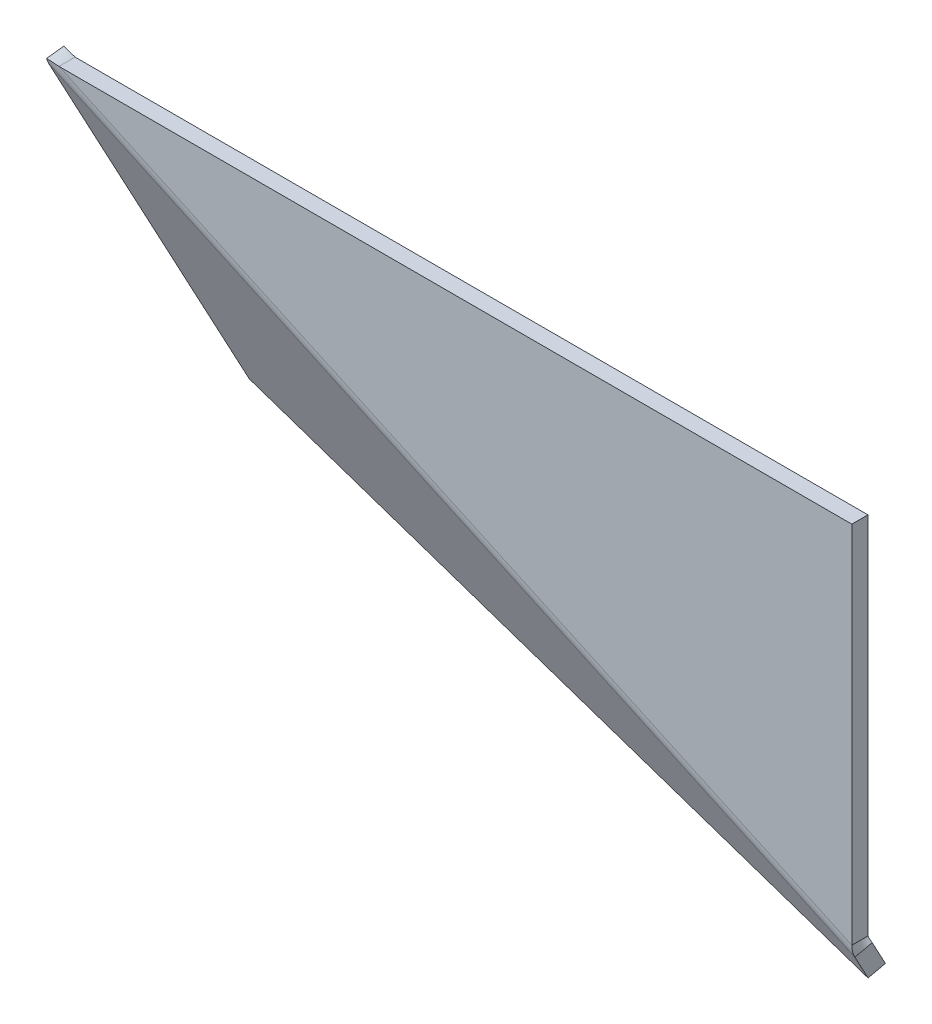
ISO-10303-21;
HEADER;
FILE_DESCRIPTION(('STEP AP214'),'2;1');
FILE_NAME('part.step','',(''),(''),'','','');
FILE_SCHEMA(('AUTOMOTIVE_DESIGN { 1 0 10303 214 1 1 1 1 }'));
ENDSEC;
DATA;
#1=APPLICATION_CONTEXT('core data for automotive mechanical design processes');
#2=APPLICATION_PROTOCOL_DEFINITION('international standard','automotive_design',2000,#1);
#3=PRODUCT_CONTEXT('',#1,'mechanical');
#4=PRODUCT('Part','Part','',(#3));
#5=PRODUCT_RELATED_PRODUCT_CATEGORY('part','',(#4));
#6=PRODUCT_DEFINITION_FORMATION('','',#4);
#7=PRODUCT_DEFINITION_CONTEXT('part definition',#1,'design');
#8=PRODUCT_DEFINITION('design','',#6,#7);
#9=PRODUCT_DEFINITION_SHAPE('','',#8);
#10=(LENGTH_UNIT() NAMED_UNIT(*) SI_UNIT(.MILLI.,.METRE.));
#11=(NAMED_UNIT(*) PLANE_ANGLE_UNIT() SI_UNIT($,.RADIAN.));
#12=(NAMED_UNIT(*) SI_UNIT($,.STERADIAN.) SOLID_ANGLE_UNIT());
#13=UNCERTAINTY_MEASURE_WITH_UNIT(LENGTH_MEASURE(1.E-05),#10,'distance_accuracy_value','');
#14=(GEOMETRIC_REPRESENTATION_CONTEXT(3) GLOBAL_UNCERTAINTY_ASSIGNED_CONTEXT((#13)) GLOBAL_UNIT_ASSIGNED_CONTEXT((#10,
#11,#12)) REPRESENTATION_CONTEXT('',''));
#15=CARTESIAN_POINT('',(0.,0.,0.));
#16=DIRECTION('',(0.,0.,1.));
#17=DIRECTION('',(1.,0.,0.));
#18=AXIS2_PLACEMENT_3D('',#15,#16,#17);
#19=CARTESIAN_POINT('',(-235.256508957324,-92.948932515923,-122.261534352774));
#20=DIRECTION('',(-0.976601993595897,0.0508652313132697,-0.208952804116071));
#21=DIRECTION('',(-0.208952804116077,-0.454245226339291,0.866025403784445));
#22=AXIS2_PLACEMENT_3D('',#19,#20,#21);
#23=PLANE('',#22);
#24=DIRECTION('',(0.0508652313132706,-0.889423410188544,-0.454245226339291));
#25=VECTOR('',#24,1.);
#26=CARTESIAN_POINT('',(-237.346036998485,-97.4913847793156,-113.60128031493));
#27=LINE('',#26,#25);
#28=CARTESIAN_POINT('',(-249.871793211292,121.532504788203,-1.74166975080103));
#29=VERTEX_POINT('',#28);
#30=CARTESIAN_POINT('',(-237.346036998485,-97.4913847793156,-113.60128031493));
#31=VERTEX_POINT('',#30);
#32=EDGE_CURVE('E93',#29,#31,#27,.T.);
#33=ORIENTED_EDGE('',*,*,#32,.F.);
#34=CARTESIAN_POINT('',(-247.78226517013,126.074957051595,-10.4019237886461));
#35=CARTESIAN_POINT('',(-249.871793211291,121.532504788203,-1.74166975080103));
#36=B_SPLINE_CURVE_WITH_KNOTS('',1,(#34,#35),.UNSPECIFIED.,.F.,.F.,(2,2),(0.,1.),.UNSPECIFIED.);
#37=CARTESIAN_POINT('',(-247.78226517013,126.074957051595,-10.4019237886452));
#38=VERTEX_POINT('',#37);
#39=EDGE_CURVE('E134',#29,#38,#36,.F.);
#40=ORIENTED_EDGE('',*,*,#39,.T.);
#41=DIRECTION('',(0.0508652313132706,-0.889423410188544,-0.454245226339291));
#42=VECTOR('',#41,1.);
#43=CARTESIAN_POINT('',(-235.256508957324,-92.948932515923,-122.261534352774));
#44=LINE('',#43,#42);
#45=CARTESIAN_POINT('',(-235.256508957324,-92.948932515923,-122.261534352774));
#46=VERTEX_POINT('',#45);
#47=EDGE_CURVE('E136',#38,#46,#44,.T.);
#48=ORIENTED_EDGE('',*,*,#47,.T.);
#49=DIRECTION('',(-0.208952804116077,-0.454245226339291,0.866025403784445));
#50=VECTOR('',#49,1.);
#51=CARTESIAN_POINT('',(-235.256508957324,-92.948932515923,-122.261534352774));
#52=LINE('',#51,#50);
#53=EDGE_CURVE('E357',#46,#31,#52,.T.);
#54=ORIENTED_EDGE('',*,*,#53,.T.);
#55=EDGE_LOOP('',(#33,#40,#48,#54));
#56=FACE_BOUND('',#55,.T.);
#57=ADVANCED_FACE('F66',(#56),#23,.T.);
#58=CARTESIAN_POINT('',(253.044487840624,-118.381548172558,-17.7851322947388));
#59=DIRECTION('',(0.976601993595897,-0.0508652313132697,0.208952804116071));
#60=DIRECTION('',(0.208952804116077,0.454245226339291,-0.866025403784445));
#61=AXIS2_PLACEMENT_3D('',#58,#59,#60);
#62=PLANE('',#61);
#63=DIRECTION('',(-0.0508652313132706,0.889423410188544,0.454245226339291));
#64=VECTOR('',#63,1.);
#65=CARTESIAN_POINT('',(253.044487840624,-118.381548172558,-17.7851322947388));
#66=LINE('',#65,#64);
#67=CARTESIAN_POINT('',(253.044487840624,-118.381548172558,-17.7851322947388));
#68=VERTEX_POINT('',#67);
#69=CARTESIAN_POINT('',(252.217734829871,-103.925042948404,-10.401923788647));
#70=VERTEX_POINT('',#69);
#71=EDGE_CURVE('E351',#68,#70,#66,.T.);
#72=ORIENTED_EDGE('',*,*,#71,.T.);
#73=CARTESIAN_POINT('',(250.12820678871,-108.467495211797,-1.74166975080248));
#74=CARTESIAN_POINT('',(252.217734829871,-103.925042948404,-10.4019237886471));
#75=B_SPLINE_CURVE_WITH_KNOTS('',1,(#73,#74),.UNSPECIFIED.,.F.,.F.,(2,2),(0.,1.),.UNSPECIFIED.);
#76=CARTESIAN_POINT('',(250.128206788709,-108.467495211797,-1.74166975080259));
#77=VERTEX_POINT('',#76);
#78=EDGE_CURVE('E12',#70,#77,#75,.F.);
#79=ORIENTED_EDGE('',*,*,#78,.T.);
#80=DIRECTION('',(-0.0508652313132706,0.889423410188544,0.454245226339291));
#81=VECTOR('',#80,1.);
#82=CARTESIAN_POINT('',(250.954959799462,-122.924000435951,-9.12487825689445));
#83=LINE('',#82,#81);
#84=CARTESIAN_POINT('',(250.954959799462,-122.924000435951,-9.12487825689445));
#85=VERTEX_POINT('',#84);
#86=EDGE_CURVE('E86',#85,#77,#83,.T.);
#87=ORIENTED_EDGE('',*,*,#86,.F.);
#88=DIRECTION('',(-0.208952804116077,-0.454245226339291,0.866025403784445));
#89=VECTOR('',#88,1.);
#90=CARTESIAN_POINT('',(253.044487840624,-118.381548172558,-17.7851322947388));
#91=LINE('',#90,#89);
#92=EDGE_CURVE('E169',#68,#85,#91,.T.);
#93=ORIENTED_EDGE('',*,*,#92,.F.);
#94=EDGE_LOOP('',(#72,#79,#87,#93));
#95=FACE_BOUND('',#94,.T.);
#96=ADVANCED_FACE('F68',(#95),#62,.T.);
#97=CARTESIAN_POINT('',(0.446307486328845,0.970233665934295,-4.58242599350078));
#98=DIRECTION('',(-0.208952804116077,-0.454245226339291,0.866025403784445));
#99=DIRECTION('',(0.976601993595897,-0.0508652313132697,0.208952804116071));
#100=AXIS2_PLACEMENT_3D('',#97,#98,#99);
#101=PLANE('',#100);
#102=ORIENTED_EDGE('',*,*,#86,.T.);
#103=DIRECTION('',(-0.908490452678576,0.417905608232145,0.));
#104=VECTOR('',#103,1.);
#105=CARTESIAN_POINT('',(2.50254271959727,5.44031025999459,-1.74166975080237));
#106=LINE('',#105,#104);
#107=EDGE_CURVE('E79',#77,#29,#106,.T.);
#108=ORIENTED_EDGE('',*,*,#107,.T.);
#109=ORIENTED_EDGE('',*,*,#32,.T.);
#110=DIRECTION('',(0.976601993595897,-0.0508652313132697,0.208952804116071));
#111=VECTOR('',#110,1.);
#112=CARTESIAN_POINT('',(250.954959799462,-122.924000435951,-9.12487825689445));
#113=LINE('',#112,#111);
#114=EDGE_CURVE('E352',#31,#85,#113,.T.);
#115=ORIENTED_EDGE('',*,*,#114,.T.);
#116=EDGE_LOOP('',(#102,#108,#109,#115));
#117=FACE_BOUND('',#116,.T.);
#118=ADVANCED_FACE('F390',(#117),#101,.T.);
#119=CARTESIAN_POINT('',(253.044487840624,-118.381548172558,-17.7851322947388));
#120=DIRECTION('',(0.0508652313132707,-0.889423410188546,-0.45424522633929));
#121=DIRECTION('',(0.976601993595897,-0.0508652313132697,0.208952804116071));
#122=AXIS2_PLACEMENT_3D('',#119,#120,#121);
#123=PLANE('',#122);
#124=ORIENTED_EDGE('',*,*,#114,.F.);
#125=ORIENTED_EDGE('',*,*,#53,.F.);
#126=DIRECTION('',(0.976601993595897,-0.0508652313132697,0.208952804116071));
#127=VECTOR('',#126,1.);
#128=CARTESIAN_POINT('',(253.044487840624,-118.381548172558,-17.7851322947388));
#129=LINE('',#128,#127);
#130=EDGE_CURVE('E153',#46,#68,#129,.T.);
#131=ORIENTED_EDGE('',*,*,#130,.T.);
#132=ORIENTED_EDGE('',*,*,#92,.T.);
#133=EDGE_LOOP('',(#124,#125,#131,#132));
#134=FACE_BOUND('',#133,.T.);
#135=ADVANCED_FACE('F331',(#134),#123,.T.);
#136=CARTESIAN_POINT('',(2.53583552749082,5.51268592932763,-13.2426800313452));
#137=DIRECTION('',(-0.208952804116077,-0.454245226339291,0.866025403784445));
#138=DIRECTION('',(0.976601993595897,-0.0508652313132697,0.208952804116071));
#139=AXIS2_PLACEMENT_3D('',#136,#137,#138);
#140=PLANE('',#139);
#141=DIRECTION('',(-0.908490452678576,0.417905608232145,0.));
#142=VECTOR('',#141,1.);
#143=CARTESIAN_POINT('',(4.59207076075802,9.98276252338748,-10.4019237886466));
#144=LINE('',#143,#142);
#145=EDGE_CURVE('E144',#70,#38,#144,.T.);
#146=ORIENTED_EDGE('',*,*,#145,.F.);
#147=ORIENTED_EDGE('',*,*,#71,.F.);
#148=ORIENTED_EDGE('',*,*,#130,.F.);
#149=ORIENTED_EDGE('',*,*,#47,.F.);
#150=EDGE_LOOP('',(#146,#147,#148,#149));
#151=FACE_BOUND('',#150,.T.);
#152=ADVANCED_FACE('F149',(#151),#140,.F.);
#153=CARTESIAN_POINT('',(0.,0.,-10.));
#154=DIRECTION('',(0.,0.,1.00000000000001));
#155=DIRECTION('',(1.,0.,0.));
#156=AXIS2_PLACEMENT_3D('',#153,#154,#155);
#157=PLANE('',#156);
#158=DIRECTION('',(0.,1.,0.));
#159=VECTOR('',#158,1.);
#160=CARTESIAN_POINT('',(250.,-125.,-10.0000000000005));
#161=LINE('',#160,#159);
#162=CARTESIAN_POINT('',(250.,-101.253794377965,-10.0000000000002));
#163=VERTEX_POINT('',#162);
#164=CARTESIAN_POINT('',(250.000000000001,125.000000000001,-10.0000000000007));
#165=VERTEX_POINT('',#164);
#166=EDGE_CURVE('E290',#163,#165,#161,.T.);
#167=ORIENTED_EDGE('',*,*,#166,.F.);
#168=DIRECTION('',(-0.908490452678576,0.417905608232144,0.));
#169=VECTOR('',#168,1.);
#170=CARTESIAN_POINT('',(5.21892917310574,11.3454982024047,-10.));
#171=LINE('',#170,#169);
#172=CARTESIAN_POINT('',(-241.856074734708,125.,-9.99999999999979));
#173=VERTEX_POINT('',#172);
#174=EDGE_CURVE('E295',#163,#173,#171,.T.);
#175=ORIENTED_EDGE('',*,*,#174,.T.);
#176=DIRECTION('',(-1.,0.,0.));
#177=VECTOR('',#176,1.);
#178=CARTESIAN_POINT('',(250.000000000001,125.000000000001,-10.0000000000007));
#179=LINE('',#178,#177);
#180=EDGE_CURVE('E291',#165,#173,#179,.T.);
#181=ORIENTED_EDGE('',*,*,#180,.F.);
#182=EDGE_LOOP('',(#167,#175,#181));
#183=FACE_BOUND('',#182,.T.);
#184=ADVANCED_FACE('F322',(#183),#157,.F.);
#185=CARTESIAN_POINT('',(250.000000000001,125.000000000001,-10.0000000000007));
#186=DIRECTION('',(0.,1.,0.));
#187=DIRECTION('',(-1.,0.,0.));
#188=AXIS2_PLACEMENT_3D('',#185,#186,#187);
#189=PLANE('',#188);
#190=CARTESIAN_POINT('',(-241.856074734708,124.999999999999,7.7715611723761E-13));
#191=CARTESIAN_POINT('',(-241.856074734708,125.,-9.99999999999979));
#192=B_SPLINE_CURVE_WITH_KNOTS('',1,(#190,#191),.UNSPECIFIED.,.F.,.F.,(2,2),(0.,1.),.UNSPECIFIED.);
#193=CARTESIAN_POINT('',(-241.856074734708,124.999999999999,9.99200722162641E-13));
#194=VERTEX_POINT('',#193);
#195=EDGE_CURVE('E277',#194,#173,#192,.T.);
#196=ORIENTED_EDGE('',*,*,#195,.F.);
#197=DIRECTION('',(-1.,0.,0.));
#198=VECTOR('',#197,1.);
#199=CARTESIAN_POINT('',(250.,125.,-4.44089209850063E-13));
#200=LINE('',#199,#198);
#201=CARTESIAN_POINT('',(250.,125.,-4.44089209850063E-13));
#202=VERTEX_POINT('',#201);
#203=EDGE_CURVE('E346',#202,#194,#200,.T.);
#204=ORIENTED_EDGE('',*,*,#203,.F.);
#205=DIRECTION('',(0.,0.,1.00000000000001));
#206=VECTOR('',#205,1.);
#207=CARTESIAN_POINT('',(250.000000000001,125.000000000001,-10.0000000000007));
#208=LINE('',#207,#206);
#209=EDGE_CURVE('E281',#165,#202,#208,.T.);
#210=ORIENTED_EDGE('',*,*,#209,.F.);
#211=ORIENTED_EDGE('',*,*,#180,.T.);
#212=EDGE_LOOP('',(#196,#204,#210,#211));
#213=FACE_BOUND('',#212,.T.);
#214=ADVANCED_FACE('F312',(#213),#189,.T.);
#215=CARTESIAN_POINT('',(0.,0.,0.));
#216=DIRECTION('',(0.,0.,1.00000000000001));
#217=DIRECTION('',(1.,0.,0.));
#218=AXIS2_PLACEMENT_3D('',#215,#216,#217);
#219=PLANE('',#218);
#220=DIRECTION('',(-0.908490452678576,0.417905608232144,0.));
#221=VECTOR('',#220,1.);
#222=CARTESIAN_POINT('',(5.21892917310629,11.345498202405,-2.22044604925031E-13));
#223=LINE('',#222,#221);
#224=CARTESIAN_POINT('',(249.999999999999,-101.253794377966,-4.44089209850063E-13));
#225=VERTEX_POINT('',#224);
#226=EDGE_CURVE('E310',#225,#194,#223,.T.);
#227=ORIENTED_EDGE('',*,*,#226,.F.);
#228=DIRECTION('',(0.,1.,0.));
#229=VECTOR('',#228,1.);
#230=CARTESIAN_POINT('',(250.,-125.,-2.22044604925031E-13));
#231=LINE('',#230,#229);
#232=EDGE_CURVE('E294',#225,#202,#231,.T.);
#233=ORIENTED_EDGE('',*,*,#232,.T.);
#234=ORIENTED_EDGE('',*,*,#203,.T.);
#235=EDGE_LOOP('',(#227,#233,#234));
#236=FACE_BOUND('',#235,.T.);
#237=ADVANCED_FACE('F321',(#236),#219,.T.);
#238=CARTESIAN_POINT('',(250.,-125.,-10.0000000000005));
#239=DIRECTION('',(1.,0.,0.));
#240=DIRECTION('',(0.,0.,-1.00000000000001));
#241=AXIS2_PLACEMENT_3D('',#238,#239,#240);
#242=PLANE('',#241);
#243=CARTESIAN_POINT('',(250.,-101.253794377966,-10.0000000000007));
#244=CARTESIAN_POINT('',(250.,-101.253794377966,-4.44089209850063E-13));
#245=B_SPLINE_CURVE_WITH_KNOTS('',1,(#243,#244),.UNSPECIFIED.,.F.,.F.,(2,2),(0.,1.),.UNSPECIFIED.);
#246=EDGE_CURVE('E264',#163,#225,#245,.T.);
#247=ORIENTED_EDGE('',*,*,#246,.F.);
#248=ORIENTED_EDGE('',*,*,#166,.T.);
#249=ORIENTED_EDGE('',*,*,#209,.T.);
#250=ORIENTED_EDGE('',*,*,#232,.F.);
#251=EDGE_LOOP('',(#247,#248,#249,#250));
#252=FACE_BOUND('',#251,.T.);
#253=ADVANCED_FACE('F325',(#252),#242,.T.);
#254=CARTESIAN_POINT('',(250.,-101.253794377966,-4.44089209850063E-13));
#255=CARTESIAN_POINT('',(250.,-103.754778383535,-4.44089209850063E-13));
#256=CARTESIAN_POINT('',(250.000993658756,-106.243061488737,-0.605609705122134));
#257=CARTESIAN_POINT('',(250.12820678871,-108.467495211797,-1.74166975080248));
#258=CARTESIAN_POINT('',(250.,-101.253794377966,-10.0000000000007));
#259=CARTESIAN_POINT('',(250.729691205144,-102.166035287214,-10.0000000000005));
#260=CARTESIAN_POINT('',(251.458715599355,-103.07655861605,-10.1400137338031));
#261=CARTESIAN_POINT('',(252.217734829871,-103.925042948404,-10.4019237886471));
#262=B_SPLINE_SURFACE_WITH_KNOTS('',1,3,((#254,#255,#256,#257),(#258,#259,#260,#261)),
.UNSPECIFIED.,.F.,.F.,.F.,(2,2),(4,4),(0.,1.),(0.,1.),.UNSPECIFIED.);
#263=CARTESIAN_POINT('',(250.,-101.253794377966,-4.44089209850063E-13));
#264=CARTESIAN_POINT('',(250.,-103.754778383535,-4.44089209850063E-13));
#265=CARTESIAN_POINT('',(250.000993658756,-106.243061488737,-0.605609705122134));
#266=CARTESIAN_POINT('',(250.12820678871,-108.467495211797,-1.74166975080248));
#267=B_SPLINE_CURVE_WITH_KNOTS('',3,(#263,#264,#265,#266),.UNSPECIFIED.,.F.,.F.,(4,4),(0.,1.),.UNSPECIFIED.);
#268=EDGE_CURVE('E576',#225,#77,#267,.T.);
#269=CARTESIAN_POINT('',(252.217734829871,-103.925042948404,-10.4019237886471));
#270=CARTESIAN_POINT('',(251.458715599355,-103.07655861605,-10.1400137338031));
#271=CARTESIAN_POINT('',(250.729691205144,-102.166035287214,-10.0000000000005));
#272=CARTESIAN_POINT('',(250.,-101.253794377966,-10.0000000000007));
#273=B_SPLINE_CURVE_WITH_KNOTS('',3,(#269,#270,#271,#272),.UNSPECIFIED.,.F.,.F.,(4,4),(0.,1.),.UNSPECIFIED.);
#274=EDGE_CURVE('E166',#163,#70,#273,.F.);
#275=ORIENTED_EDGE('',*,*,#246,.T.);
#276=ORIENTED_EDGE('',*,*,#268,.T.);
#277=ORIENTED_EDGE('',*,*,#78,.F.);
#278=ORIENTED_EDGE('',*,*,#274,.F.);
#279=EDGE_LOOP('',(#275,#276,#277,#278));
#280=FACE_BOUND('',#279,.T.);
#281=ADVANCED_FACE('F200',(#280),#262,.F.);
#282=CARTESIAN_POINT('',(-249.871793211291,121.532504788203,-1.74166975080103));
#283=CARTESIAN_POINT('',(-249.935317363839,122.643280595762,-1.17437570126677));
#284=CARTESIAN_POINT('',(-249.967652180617,123.821449555125,-0.736617266626993));
#285=CARTESIAN_POINT('',(-249.983808474944,125.035198967512,-0.442964258241418));
#286=CARTESIAN_POINT('',(-247.78226517013,126.074957051595,-10.4019237886461));
#287=CARTESIAN_POINT('',(-248.161625171849,126.499031969382,-10.2710203874401));
#288=CARTESIAN_POINT('',(-248.533759326843,126.938709150557,-10.1699831077342));
#289=CARTESIAN_POINT('',(-248.902189170288,127.386545281982,-10.1022225211325));
#290=B_SPLINE_SURFACE_WITH_KNOTS('',1,3,((#282,#283,#284,#285),(#286,#287,#288,#289)),
.UNSPECIFIED.,.F.,.F.,.F.,(2,2),(4,4),(0.,1.),(0.,1.),.UNSPECIFIED.);
#291=CARTESIAN_POINT('',(-249.871793211291,121.532504788203,-1.74166975080103));
#292=CARTESIAN_POINT('',(-249.935317363839,122.643280595762,-1.17437570126677));
#293=CARTESIAN_POINT('',(-249.967652180617,123.821449555125,-0.736617266626993));
#294=CARTESIAN_POINT('',(-249.983808474944,125.035198967512,-0.442964258241418));
#295=B_SPLINE_CURVE_WITH_KNOTS('',3,(#291,#292,#293,#294),.UNSPECIFIED.,.F.,.F.,(4,4),(0.,1.),.UNSPECIFIED.);
#296=CARTESIAN_POINT('',(-249.98380847224,125.035198764354,-0.442964307392657));
#297=VERTEX_POINT('',#296);
#298=EDGE_CURVE('E586',#29,#297,#295,.T.);
#299=CARTESIAN_POINT('',(-249.983808474944,125.035198967512,-0.442964258241418));
#300=CARTESIAN_POINT('',(-248.902189170288,127.386545281982,-10.1022225211325));
#301=B_SPLINE_CURVE_WITH_KNOTS('',1,(#299,#300),.UNSPECIFIED.,.F.,.F.,(2,2),(0.,1.),.UNSPECIFIED.);
#302=CARTESIAN_POINT('',(-248.902189170288,127.386545281982,-10.1022225211325));
#303=VERTEX_POINT('',#302);
#304=EDGE_CURVE('E173',#297,#303,#301,.T.);
#305=CARTESIAN_POINT('',(-248.902189170288,127.386545281982,-10.1022225211325));
#306=CARTESIAN_POINT('',(-248.533759326843,126.938709150557,-10.1699831077342));
#307=CARTESIAN_POINT('',(-248.161625171849,126.499031969382,-10.2710203874401));
#308=CARTESIAN_POINT('',(-247.78226517013,126.074957051595,-10.4019237886461));
#309=B_SPLINE_CURVE_WITH_KNOTS('',3,(#305,#306,#307,#308),.UNSPECIFIED.,.F.,.F.,(4,4),(0.,1.),.UNSPECIFIED.);
#310=EDGE_CURVE('E161',#38,#303,#309,.F.);
#311=ORIENTED_EDGE('',*,*,#39,.F.);
#312=ORIENTED_EDGE('',*,*,#298,.T.);
#313=ORIENTED_EDGE('',*,*,#304,.T.);
#314=ORIENTED_EDGE('',*,*,#310,.F.);
#315=EDGE_LOOP('',(#311,#312,#313,#314));
#316=FACE_BOUND('',#315,.T.);
#317=ADVANCED_FACE('F172',(#316),#290,.F.);
#318=CARTESIAN_POINT('',(-249.983808474944,125.035198967512,-0.442964258241418));
#319=CARTESIAN_POINT('',(-247.285254688419,125.000079563525,-0.14933612326018));
#320=CARTESIAN_POINT('',(-244.570783447071,124.999999999999,6.66133814775094E-13));
#321=CARTESIAN_POINT('',(-241.856074734708,124.999999999999,7.7715611723761E-13));
#322=CARTESIAN_POINT('',(-248.902189170288,127.386545281982,-10.1022225211325));
#323=CARTESIAN_POINT('',(-246.555963070018,126.585632241335,-10.0344637451492));
#324=CARTESIAN_POINT('',(-244.2060288088,125.792808749729,-9.99999999999956));
#325=CARTESIAN_POINT('',(-241.856074734708,125.,-9.99999999999979));
#326=B_SPLINE_SURFACE_WITH_KNOTS('',1,3,((#318,#319,#320,#321),(#322,#323,#324,#325)),
.UNSPECIFIED.,.F.,.F.,.F.,(2,2),(4,4),(0.,1.),(0.,1.),.UNSPECIFIED.);
#327=CARTESIAN_POINT('',(-249.983808474944,125.035198967512,-0.442964258241418));
#328=CARTESIAN_POINT('',(-247.285254688419,125.000079563525,-0.14933612326018));
#329=CARTESIAN_POINT('',(-244.570783447071,124.999999999999,6.66133814775094E-13));
#330=CARTESIAN_POINT('',(-241.856074734708,124.999999999999,7.7715611723761E-13));
#331=B_SPLINE_CURVE_WITH_KNOTS('',3,(#327,#328,#329,#330),.UNSPECIFIED.,.F.,.F.,(4,4),(0.,1.),.UNSPECIFIED.);
#332=EDGE_CURVE('E589',#297,#194,#331,.T.);
#333=CARTESIAN_POINT('',(-241.856074734708,125.,-9.99999999999979));
#334=CARTESIAN_POINT('',(-244.2060288088,125.792808749729,-9.99999999999956));
#335=CARTESIAN_POINT('',(-246.555963070018,126.585632241335,-10.0344637451492));
#336=CARTESIAN_POINT('',(-248.902189170288,127.386545281982,-10.1022225211325));
#337=B_SPLINE_CURVE_WITH_KNOTS('',3,(#333,#334,#335,#336),.UNSPECIFIED.,.F.,.F.,(4,4),(0.,1.),.UNSPECIFIED.);
#338=EDGE_CURVE('E176',#303,#173,#337,.F.);
#339=ORIENTED_EDGE('',*,*,#304,.F.);
#340=ORIENTED_EDGE('',*,*,#332,.T.);
#341=ORIENTED_EDGE('',*,*,#195,.T.);
#342=ORIENTED_EDGE('',*,*,#338,.F.);
#343=EDGE_LOOP('',(#339,#340,#341,#342));
#344=FACE_BOUND('',#343,.T.);
#345=ADVANCED_FACE('F199',(#344),#326,.F.);
#346=CARTESIAN_POINT('',(505.586085254091,-218.823393594847,-13.0000000000008));
#347=DIRECTION('',(-0.908490452678576,0.417905608232145,0.));
#348=DIRECTION('',(-0.417905608232146,-0.908490452678577,0.));
#349=AXIS2_PLACEMENT_3D('',#346,#347,#348);
#350=CYLINDRICAL_SURFACE('',#349,3.);
#351=ORIENTED_EDGE('',*,*,#338,.T.);
#352=ORIENTED_EDGE('',*,*,#174,.F.);
#353=ORIENTED_EDGE('',*,*,#274,.T.);
#354=ORIENTED_EDGE('',*,*,#145,.T.);
#355=ORIENTED_EDGE('',*,*,#310,.T.);
#356=EDGE_LOOP('',(#351,#352,#353,#354,#355));
#357=FACE_BOUND('',#356,.T.);
#358=ADVANCED_FACE('F160',(#357),#350,.F.);
#359=CARTESIAN_POINT('',(505.586085254091,-218.823393594847,-13.0000000000008));
#360=DIRECTION('',(-0.908490452678576,0.417905608232145,0.));
#361=DIRECTION('',(-0.417905608232146,-0.908490452678577,0.));
#362=AXIS2_PLACEMENT_3D('',#359,#360,#361);
#363=CYLINDRICAL_SURFACE('',#362,13.);
#364=ORIENTED_EDGE('',*,*,#332,.F.);
#365=ORIENTED_EDGE('',*,*,#298,.F.);
#366=ORIENTED_EDGE('',*,*,#107,.F.);
#367=ORIENTED_EDGE('',*,*,#268,.F.);
#368=ORIENTED_EDGE('',*,*,#226,.T.);
#369=EDGE_LOOP('',(#364,#365,#366,#367,#368));
#370=FACE_BOUND('',#369,.T.);
#371=ADVANCED_FACE('F485',(#370),#363,.T.);
#372=CLOSED_SHELL('',(#57,#96,#118,#135,#152,#184,#214,#237,#253,#281,#317,#345,#358,#371));
#373=MANIFOLD_SOLID_BREP('B2',#372);
#374=ADVANCED_BREP_SHAPE_REPRESENTATION('',(#18,#373),#14);
#375=SHAPE_DEFINITION_REPRESENTATION(#9,#374);
ENDSEC;
END-ISO-10303-21;
